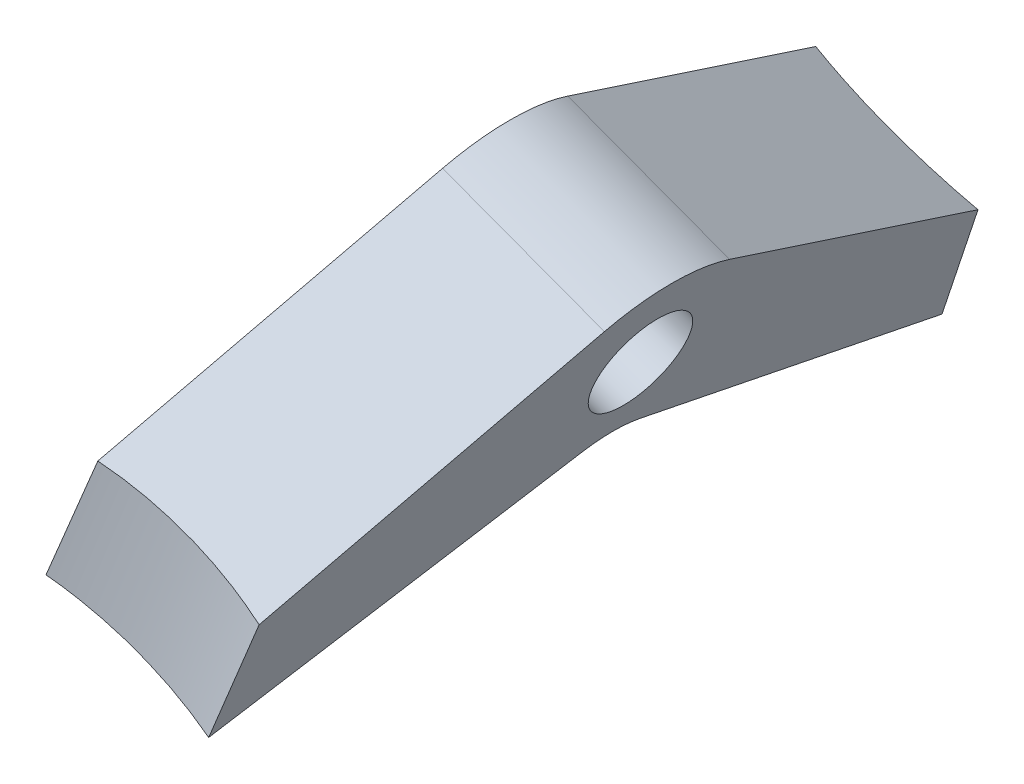
ISO-10303-21;
HEADER;
FILE_DESCRIPTION(('STEP AP214'),'2;1');
FILE_NAME('part.step','',(''),(''),'','','');
FILE_SCHEMA(('AUTOMOTIVE_DESIGN { 1 0 10303 214 1 1 1 1 }'));
ENDSEC;
DATA;
#1=APPLICATION_CONTEXT('core data for automotive mechanical design processes');
#2=APPLICATION_PROTOCOL_DEFINITION('international standard','automotive_design',2000,#1);
#3=PRODUCT_CONTEXT('',#1,'mechanical');
#4=PRODUCT('Part','Part','',(#3));
#5=PRODUCT_RELATED_PRODUCT_CATEGORY('part','',(#4));
#6=PRODUCT_DEFINITION_FORMATION('','',#4);
#7=PRODUCT_DEFINITION_CONTEXT('part definition',#1,'design');
#8=PRODUCT_DEFINITION('design','',#6,#7);
#9=PRODUCT_DEFINITION_SHAPE('','',#8);
#10=(LENGTH_UNIT() NAMED_UNIT(*) SI_UNIT(.MILLI.,.METRE.));
#11=(NAMED_UNIT(*) PLANE_ANGLE_UNIT() SI_UNIT($,.RADIAN.));
#12=(NAMED_UNIT(*) SI_UNIT($,.STERADIAN.) SOLID_ANGLE_UNIT());
#13=UNCERTAINTY_MEASURE_WITH_UNIT(LENGTH_MEASURE(1.E-05),#10,'distance_accuracy_value','');
#14=(GEOMETRIC_REPRESENTATION_CONTEXT(3) GLOBAL_UNCERTAINTY_ASSIGNED_CONTEXT((#13)) GLOBAL_UNIT_ASSIGNED_CONTEXT((#10,
#11,#12)) REPRESENTATION_CONTEXT('',''));
#15=CARTESIAN_POINT('',(0.,0.,0.));
#16=DIRECTION('',(0.,0.,1.));
#17=DIRECTION('',(1.,0.,0.));
#18=AXIS2_PLACEMENT_3D('',#15,#16,#17);
#19=CARTESIAN_POINT('',(-440.159363402594,388.955340973539,1.82761171745082E-12));
#20=DIRECTION('',(0.936746949010764,-0.350007362092606,0.));
#21=DIRECTION('',(0.350007362092606,0.936746949010764,0.));
#22=AXIS2_PLACEMENT_3D('',#19,#20,#21);
#23=PLANE('',#22);
#24=CARTESIAN_POINT('',(-432.537547810981,409.354090470349,-28.4014475028517));
#25=CARTESIAN_POINT('',(-433.547468481025,406.651175592356,-28.5675876473756));
#26=CARTESIAN_POINT('',(-434.557375484195,403.94829729189,-28.7344053815361));
#27=CARTESIAN_POINT('',(-436.577163836364,398.542609350843,-29.0692977530301));
#28=CARTESIAN_POINT('',(-437.587045185367,395.839799710254,-29.2373723902067));
#29=CARTESIAN_POINT('',(-439.074292173246,391.859386069833,-29.4857511303396));
#30=CARTESIAN_POINT('',(-439.551667022951,390.581757418473,-29.565605355142));
#31=CARTESIAN_POINT('',(-440.506411771587,388.026513365829,-29.7255564123936));
#32=CARTESIAN_POINT('',(-440.983781670517,386.748897964545,-29.805653244857));
#33=CARTESIAN_POINT('',(-441.461149241016,385.47128879499,-29.8858632241342));
#34=B_SPLINE_CURVE_WITH_KNOTS('',3,(#24,#25,#26,#27,#28,#29,#30,#31,#32,#33),.UNSPECIFIED.,.F.,
.F.,(4,2,2,2,4),(0.,8.67061810089355,17.3412351202483,21.4399404760988,25.5386460736263),.UNSPECIFIED.);
#35=CARTESIAN_POINT('',(-436.909750498083,397.652486529471,-29.1248080730223));
#36=VERTEX_POINT('',#35);
#37=CARTESIAN_POINT('',(-440.410520596403,388.283153012646,-29.7095172030644));
#38=VERTEX_POINT('',#37);
#39=EDGE_CURVE('E120',#36,#38,#34,.T.);
#40=ORIENTED_EDGE('',*,*,#39,.F.);
#41=DIRECTION('',(0.147919502964028,0.39588636728183,0.906307787036651));
#42=VECTOR('',#41,1.);
#43=CARTESIAN_POINT('',(-438.452634243935,393.523168697513,-38.5781088571552));
#44=LINE('',#43,#42);
#45=CARTESIAN_POINT('',(-432.983970110522,408.159302096284,-5.07141914088655));
#46=VERTEX_POINT('',#45);
#47=EDGE_CURVE('E128',#36,#46,#44,.T.);
#48=ORIENTED_EDGE('',*,*,#47,.T.);
#49=CARTESIAN_POINT('',(-436.790542883938,397.971529443828,1.82761171745082E-12));
#50=DIRECTION('',(0.936746949010764,-0.350007362092606,0.));
#51=DIRECTION('',(0.350007362092606,0.936746949010764,0.));
#52=AXIS2_PLACEMENT_3D('',#49,#50,#51);
#53=CIRCLE('',#52,12.);
#54=CARTESIAN_POINT('',(-432.983970110522,408.159302096284,5.0714191408902));
#55=VERTEX_POINT('',#54);
#56=EDGE_CURVE('E138',#46,#55,#53,.T.);
#57=ORIENTED_EDGE('',*,*,#56,.T.);
#58=DIRECTION('',(-0.14791950296402,-0.395886367281833,0.90630778703665));
#59=VECTOR('',#58,1.);
#60=CARTESIAN_POINT('',(-438.452634243935,393.523168697513,38.5781088571589));
#61=LINE('',#60,#59);
#62=CARTESIAN_POINT('',(-436.909750498082,397.652486529473,29.1248080730222));
#63=VERTEX_POINT('',#62);
#64=EDGE_CURVE('E140',#55,#63,#61,.T.);
#65=ORIENTED_EDGE('',*,*,#64,.T.);
#66=CARTESIAN_POINT('',(-441.461149241016,385.47128879499,29.8858632241342));
#67=CARTESIAN_POINT('',(-440.451300886093,388.174010131424,29.7161750917279));
#68=CARTESIAN_POINT('',(-439.441441791488,390.876760211156,29.54700749103));
#69=CARTESIAN_POINT('',(-437.421700090171,396.282323297564,29.2098286661728));
#70=CARTESIAN_POINT('',(-436.411817483463,398.985136304231,29.04181744186));
#71=CARTESIAN_POINT('',(-434.924532123886,402.965652641265,28.7953216591227));
#72=CARTESIAN_POINT('',(-434.447139393427,404.243329148021,28.7163433571959));
#73=CARTESIAN_POINT('',(-433.492348038862,406.798697935075,28.5586766101273));
#74=CARTESIAN_POINT('',(-433.014949414755,408.076390215375,28.4799881650037));
#75=CARTESIAN_POINT('',(-432.537547810981,409.354090470349,28.4014475028518));
#76=B_SPLINE_CURVE_WITH_KNOTS('',3,(#66,#67,#68,#69,#70,#71,#72,#73,#74,#75),.UNSPECIFIED.,.F.,
.F.,(4,2,2,2,4),(0.,8.6706178921429,17.3412346335936,21.4399402330747,25.5386460896858),.UNSPECIFIED.);
#77=CARTESIAN_POINT('',(-440.410520596393,388.283153012672,29.7095172030628));
#78=VERTEX_POINT('',#77);
#79=EDGE_CURVE('E79',#78,#63,#76,.T.);
#80=ORIENTED_EDGE('',*,*,#79,.F.);
#81=DIRECTION('',(0.102332249120521,0.273878302376099,-0.956304755963036));
#82=VECTOR('',#81,1.);
#83=CARTESIAN_POINT('',(-441.40824251317,385.612886433382,39.0333249208962));
#84=LINE('',#83,#82);
#85=CARTESIAN_POINT('',(-437.481653762664,396.121865473322,2.3389736377837));
#86=VERTEX_POINT('',#85);
#87=EDGE_CURVE('E249',#78,#86,#84,.T.);
#88=ORIENTED_EDGE('',*,*,#87,.T.);
#89=CARTESIAN_POINT('',(-440.159363402594,388.955340973539,1.82761171745082E-12));
#90=DIRECTION('',(-0.936746949010764,0.350007362092606,0.));
#91=DIRECTION('',(0.350007362092606,0.936746949010764,0.));
#92=AXIS2_PLACEMENT_3D('',#89,#90,#91);
#93=CIRCLE('',#92,8.00000000000003);
#94=CARTESIAN_POINT('',(-437.481653762664,396.121865473322,-2.33897363778005));
#95=VERTEX_POINT('',#94);
#96=EDGE_CURVE('E142',#86,#95,#93,.T.);
#97=ORIENTED_EDGE('',*,*,#96,.T.);
#98=DIRECTION('',(-0.102332249120525,-0.273878302376096,-0.956304755963037));
#99=VECTOR('',#98,1.);
#100=CARTESIAN_POINT('',(-441.40824251317,385.612886433382,-39.0333249208926));
#101=LINE('',#100,#99);
#102=EDGE_CURVE('E131',#95,#38,#101,.T.);
#103=ORIENTED_EDGE('',*,*,#102,.T.);
#104=EDGE_LOOP('',(#40,#48,#57,#65,#80,#88,#97,#103));
#105=FACE_BOUND('',#104,.T.);
#106=CARTESIAN_POINT('',(-435.131320724038,402.412211167564,1.82761171745082E-12));
#107=DIRECTION('',(-0.936746949010764,0.350007362092606,0.));
#108=DIRECTION('',(-0.350007362092606,-0.936746949010764,0.));
#109=AXIS2_PLACEMENT_3D('',#106,#107,#108);
#110=CIRCLE('',#109,4.);
#111=CARTESIAN_POINT('',(-436.531350172408,398.665223371521,1.82761171745082E-12));
#112=VERTEX_POINT('',#111);
#113=EDGE_CURVE('E263',#112,#112,#110,.T.);
#114=ORIENTED_EDGE('',*,*,#113,.T.);
#115=EDGE_LOOP('',(#114));
#116=FACE_BOUND('',#115,.T.);
#117=ADVANCED_FACE('F51',(#105,#116),#23,.T.);
#118=CARTESIAN_POINT('',(-453.273820688745,393.855444042836,1.87649248450635E-12));
#119=DIRECTION('',(0.936746949010764,-0.350007362092606,0.));
#120=DIRECTION('',(0.350007362092606,0.936746949010764,0.));
#121=AXIS2_PLACEMENT_3D('',#118,#119,#120);
#122=PLANE('',#121);
#123=DIRECTION('',(0.147919502964028,0.39588636728183,0.906307787036651));
#124=VECTOR('',#123,1.);
#125=CARTESIAN_POINT('',(-451.567091530086,398.42327176681,-38.5781088571552));
#126=LINE('',#125,#124);
#127=CARTESIAN_POINT('',(-450.017747476125,402.569879731964,-29.0852255472009));
#128=VERTEX_POINT('',#127);
#129=CARTESIAN_POINT('',(-446.098427396673,413.05940516558,-5.0714191408865));
#130=VERTEX_POINT('',#129);
#131=EDGE_CURVE('E233',#128,#130,#126,.T.);
#132=ORIENTED_EDGE('',*,*,#131,.F.);
#133=CARTESIAN_POINT('',(-445.652005097132,414.254193539646,-28.2300543513848));
#134=CARTESIAN_POINT('',(-446.661225879503,411.553151815514,-28.4278802092125));
#135=CARTESIAN_POINT('',(-447.670446697856,408.852109995087,-28.6257054460732));
#136=CARTESIAN_POINT('',(-449.688897729712,403.450001209392,-29.0209625715463));
#137=CARTESIAN_POINT('',(-450.698127943216,400.748934244124,-29.2183944601733));
#138=CARTESIAN_POINT('',(-452.185402490586,396.768446844483,-29.5087629093765));
#139=CARTESIAN_POINT('',(-452.663439535833,395.489045917109,-29.6020040821829));
#140=CARTESIAN_POINT('',(-453.619518858075,392.9302300603,-29.7882675574307));
#141=CARTESIAN_POINT('',(-454.097561135069,391.650815130867,-29.8812898598684));
#142=CARTESIAN_POINT('',(-454.575606527167,390.371391864287,-29.9741813979328));
#143=B_SPLINE_CURVE_WITH_KNOTS('',3,(#133,#134,#135,#136,#137,#138,#139,#140,#141,#142),
.UNSPECIFIED.,.F.,.F.,(4,2,2,2,4),(0.,8.67061671904777,17.3412331146473,21.4481444174191,
25.5550557927574),.UNSPECIFIED.);
#144=CARTESIAN_POINT('',(-453.531568615579,393.165616884251,-29.7711082400242));
#145=VERTEX_POINT('',#144);
#146=EDGE_CURVE('E72',#128,#145,#143,.T.);
#147=ORIENTED_EDGE('',*,*,#146,.T.);
#148=DIRECTION('',(-0.102332249120525,-0.273878302376096,-0.956304755963037));
#149=VECTOR('',#148,1.);
#150=CARTESIAN_POINT('',(-454.522699799321,390.512989502678,-39.0333249208926));
#151=LINE('',#150,#149);
#152=CARTESIAN_POINT('',(-450.596111048815,401.021968542619,-2.33897363778001));
#153=VERTEX_POINT('',#152);
#154=EDGE_CURVE('E231',#153,#145,#151,.T.);
#155=ORIENTED_EDGE('',*,*,#154,.F.);
#156=CARTESIAN_POINT('',(-453.273820688745,393.855444042836,1.87649248450635E-12));
#157=DIRECTION('',(-0.936746949010764,0.350007362092606,0.));
#158=DIRECTION('',(0.350007362092606,0.936746949010764,0.));
#159=AXIS2_PLACEMENT_3D('',#156,#157,#158);
#160=CIRCLE('',#159,8.00000000000003);
#161=CARTESIAN_POINT('',(-450.596111048815,401.021968542619,2.33897363778375));
#162=VERTEX_POINT('',#161);
#163=EDGE_CURVE('E237',#162,#153,#160,.T.);
#164=ORIENTED_EDGE('',*,*,#163,.F.);
#165=DIRECTION('',(0.102332249120521,0.273878302376099,-0.956304755963036));
#166=VECTOR('',#165,1.);
#167=CARTESIAN_POINT('',(-454.52269979932,390.512989502678,39.0333249208963));
#168=LINE('',#167,#166);
#169=CARTESIAN_POINT('',(-453.531568615579,393.165616884252,29.7711082400242));
#170=VERTEX_POINT('',#169);
#171=EDGE_CURVE('E241',#170,#162,#168,.T.);
#172=ORIENTED_EDGE('',*,*,#171,.F.);
#173=CARTESIAN_POINT('',(-454.575606527166,390.371391864287,29.9741813979327));
#174=CARTESIAN_POINT('',(-453.566344787801,393.072543204222,29.7780651001336));
#175=CARTESIAN_POINT('',(-452.557096909745,395.773657446255,29.5813683152548));
#176=CARTESIAN_POINT('',(-450.538619496861,401.175836837173,29.1872086840957));
#177=CARTESIAN_POINT('',(-449.529389962032,403.87690198606,28.989745837833));
#178=CARTESIAN_POINT('',(-448.042136912125,407.857331850671,28.6984795682822));
#179=CARTESIAN_POINT('',(-447.564109938754,409.136705822045,28.6048200888178));
#180=CARTESIAN_POINT('',(-446.608057003742,411.695451057034,28.4174587659763));
#181=CARTESIAN_POINT('',(-446.130031042101,412.974822320648,28.3237569225987));
#182=CARTESIAN_POINT('',(-445.652005097131,414.254193539645,28.2300543513847));
#183=B_SPLINE_CURVE_WITH_KNOTS('',3,(#173,#174,#175,#176,#177,#178,#179,#180,#181,#182),
.UNSPECIFIED.,.F.,.F.,(4,2,2,2,4),(0.,8.67061709889206,17.341233997343,21.4481448579432,
25.5550557635129),.UNSPECIFIED.);
#184=CARTESIAN_POINT('',(-450.017747476124,402.569879731966,29.0852255472006));
#185=VERTEX_POINT('',#184);
#186=EDGE_CURVE('E198',#170,#185,#183,.T.);
#187=ORIENTED_EDGE('',*,*,#186,.T.);
#188=DIRECTION('',(-0.14791950296402,-0.395886367281833,0.90630778703665));
#189=VECTOR('',#188,1.);
#190=CARTESIAN_POINT('',(-451.567091530086,398.423271766809,38.5781088571589));
#191=LINE('',#190,#189);
#192=CARTESIAN_POINT('',(-446.098427396673,413.05940516558,5.07141914089025));
#193=VERTEX_POINT('',#192);
#194=EDGE_CURVE('E246',#193,#185,#191,.T.);
#195=ORIENTED_EDGE('',*,*,#194,.F.);
#196=CARTESIAN_POINT('',(-449.905000170089,402.871632513125,1.87649248450635E-12));
#197=DIRECTION('',(0.936746949010764,-0.350007362092606,0.));
#198=DIRECTION('',(0.350007362092606,0.936746949010764,0.));
#199=AXIS2_PLACEMENT_3D('',#196,#197,#198);
#200=CIRCLE('',#199,12.);
#201=EDGE_CURVE('E239',#130,#193,#200,.T.);
#202=ORIENTED_EDGE('',*,*,#201,.F.);
#203=EDGE_LOOP('',(#132,#147,#155,#164,#172,#187,#195,#202));
#204=FACE_BOUND('',#203,.T.);
#205=CARTESIAN_POINT('',(-448.245778010189,407.312314236861,1.87649248450635E-12));
#206=DIRECTION('',(0.936746949010764,-0.350007362092606,0.));
#207=DIRECTION('',(0.350007362092606,0.936746949010764,0.));
#208=AXIS2_PLACEMENT_3D('',#205,#206,#207);
#209=CIRCLE('',#208,3.25);
#210=CARTESIAN_POINT('',(-447.108254083388,410.356741821146,1.87649248450635E-12));
#211=VERTEX_POINT('',#210);
#212=EDGE_CURVE('E160',#211,#211,#209,.T.);
#213=ORIENTED_EDGE('',*,*,#212,.T.);
#214=EDGE_LOOP('',(#213));
#215=FACE_BOUND('',#214,.T.);
#216=ADVANCED_FACE('F212',(#204,#215),#122,.F.);
#217=CARTESIAN_POINT('',(-441.40824251317,385.612886433382,39.0333249208962));
#218=DIRECTION('',(0.334713704991236,0.895815562472857,0.292371704722735));
#219=DIRECTION('',(-0.936746949010764,0.350007362092607,0.));
#220=AXIS2_PLACEMENT_3D('',#217,#218,#219);
#221=PLANE('',#220);
#222=ORIENTED_EDGE('',*,*,#87,.F.);
#223=CARTESIAN_POINT('',(-440.410520596402,388.283153012647,29.7095172030643));
#224=CARTESIAN_POINT('',(-440.672249021889,388.396953943376,29.6604681550793));
#225=CARTESIAN_POINT('',(-440.934894362121,388.510026750069,29.6146997555236));
#226=CARTESIAN_POINT('',(-441.461846534983,388.734693971974,29.529594804441));
#227=CARTESIAN_POINT('',(-441.726153324202,388.846288425576,29.4902580855906));
#228=CARTESIAN_POINT('',(-442.5211929769,389.178773453467,29.3817161371333));
#229=CARTESIAN_POINT('',(-443.054178499893,389.397423632801,29.3219542860566));
#230=CARTESIAN_POINT('',(-444.120560627821,389.826780604139,29.2272394304157));
#231=CARTESIAN_POINT('',(-444.653920366959,390.037536682387,29.1920932099248));
#232=CARTESIAN_POINT('',(-445.456579799746,390.348889157489,29.1570238791684));
#233=CARTESIAN_POINT('',(-445.724592212065,390.451884829056,29.1482757756238));
#234=CARTESIAN_POINT('',(-446.261360621711,390.656251759372,29.1366079792472));
#235=CARTESIAN_POINT('',(-446.530116608318,390.757623041402,29.1336882028105));
#236=CARTESIAN_POINT('',(-447.170088738944,390.996731022107,29.1337251171406));
#237=CARTESIAN_POINT('',(-447.541590393099,391.133712122671,29.1393237896391));
#238=CARTESIAN_POINT('',(-448.285457304385,391.404284191205,29.1618970415209));
#239=CARTESIAN_POINT('',(-448.657822511482,391.537875350484,29.1788709774617));
#240=CARTESIAN_POINT('',(-449.40308009909,391.801459208616,29.2244479124876));
#241=CARTESIAN_POINT('',(-449.775972427839,391.931452238059,29.2530498394026));
#242=CARTESIAN_POINT('',(-450.525044522106,392.18867449237,29.3224854148134));
#243=CARTESIAN_POINT('',(-450.90122601682,392.315872047354,29.3634180782281));
#244=CARTESIAN_POINT('',(-451.653445462958,392.566122259601,29.4578188793152));
#245=CARTESIAN_POINT('',(-452.029483396693,392.689174509252,29.5112882456374));
#246=CARTESIAN_POINT('',(-452.781053956678,392.930829675018,29.6312810762838));
#247=CARTESIAN_POINT('',(-453.156586353688,393.049430981645,29.6978092095726));
#248=CARTESIAN_POINT('',(-453.531568615579,393.165616884252,29.7711082400243));
#249=B_SPLINE_CURVE_WITH_KNOTS('',3,(#223,#224,#225,#226,#227,#228,#229,#230,#231,#232,#233,
#234,#235,#236,#237,#238,#239,#240,#241,#242,#243,#244,#245,#246,#247,#248),.UNSPECIFIED.,.F.,
.F.,(4,2,2,2,2,2,2,2,2,2,2,2,4),(0.,0.868703663685519,1.73738472399406,3.47430472073009,
5.19743347894888,6.05914268599288,6.92083953211618,8.10862951033806,9.29635230680691,
10.4839656129928,11.6813817718673,12.8789153316819,14.0768778339635),.UNSPECIFIED.);
#250=EDGE_CURVE('E190',#78,#170,#249,.T.);
#251=ORIENTED_EDGE('',*,*,#250,.T.);
#252=ORIENTED_EDGE('',*,*,#171,.T.);
#253=DIRECTION('',(-0.936746949010764,0.350007362092606,0.));
#254=VECTOR('',#253,1.);
#255=CARTESIAN_POINT('',(-437.481653762664,396.121865473322,2.3389736377837));
#256=LINE('',#255,#254);
#257=EDGE_CURVE('E155',#86,#162,#256,.T.);
#258=ORIENTED_EDGE('',*,*,#257,.F.);
#259=EDGE_LOOP('',(#222,#251,#252,#258));
#260=FACE_BOUND('',#259,.T.);
#261=ADVANCED_FACE('F53',(#260),#221,.F.);
#262=CARTESIAN_POINT('',(-440.159363402594,388.955340973539,1.82761171745082E-12));
#263=DIRECTION('',(-0.936746949010764,0.350007362092606,0.));
#264=DIRECTION('',(-0.350007362092606,-0.936746949010764,0.));
#265=AXIS2_PLACEMENT_3D('',#262,#263,#264);
#266=CYLINDRICAL_SURFACE('',#265,8.00000000000003);
#267=ORIENTED_EDGE('',*,*,#163,.T.);
#268=DIRECTION('',(-0.936746949010764,0.350007362092606,0.));
#269=VECTOR('',#268,1.);
#270=CARTESIAN_POINT('',(-437.481653762664,396.121865473322,-2.33897363778005));
#271=LINE('',#270,#269);
#272=EDGE_CURVE('E152',#95,#153,#271,.T.);
#273=ORIENTED_EDGE('',*,*,#272,.F.);
#274=ORIENTED_EDGE('',*,*,#96,.F.);
#275=ORIENTED_EDGE('',*,*,#257,.T.);
#276=EDGE_LOOP('',(#267,#273,#274,#275));
#277=FACE_BOUND('',#276,.T.);
#278=ADVANCED_FACE('F254',(#277),#266,.F.);
#279=CARTESIAN_POINT('',(-441.40824251317,385.612886433382,-39.0333249208926));
#280=DIRECTION('',(0.334713704991235,0.895815562472858,-0.292371704722734));
#281=DIRECTION('',(-0.936746949010765,0.350007362092605,0.));
#282=AXIS2_PLACEMENT_3D('',#279,#280,#281);
#283=PLANE('',#282);
#284=ORIENTED_EDGE('',*,*,#154,.T.);
#285=CARTESIAN_POINT('',(-453.531568615579,393.165616884251,-29.7711082400243));
#286=CARTESIAN_POINT('',(-453.191409587863,393.06022223186,-29.7046116593843));
#287=CARTESIAN_POINT('',(-452.850794626294,392.952837092426,-29.643691890503));
#288=CARTESIAN_POINT('',(-452.169033814267,392.734351087119,-29.5326294208783));
#289=CARTESIAN_POINT('',(-451.827888017255,392.623250574823,-29.4824856979754));
#290=CARTESIAN_POINT('',(-451.145446506303,392.397600359771,-29.3925948096732));
#291=CARTESIAN_POINT('',(-450.804150833038,392.283051314811,-29.3528456753812));
#292=CARTESIAN_POINT('',(-450.121635334119,392.050691580938,-29.2834277894014));
#293=CARTESIAN_POINT('',(-449.780415511523,391.932880778485,-29.2537593891015));
#294=CARTESIAN_POINT('',(-449.06051829555,391.680953513636,-29.201500228378));
#295=CARTESIAN_POINT('',(-448.681882989441,391.546477566485,-29.1800590977517));
#296=CARTESIAN_POINT('',(-447.925414565022,391.273963275573,-29.1490102441724));
#297=CARTESIAN_POINT('',(-447.547581450456,391.135924915229,-29.1394025763137));
#298=CARTESIAN_POINT('',(-446.792974195127,390.856462816779,-29.1317722437755));
#299=CARTESIAN_POINT('',(-446.416200247283,390.715038501602,-29.1337515680777));
#300=CARTESIAN_POINT('',(-445.664117877248,390.429006349907,-29.1491421693238));
#301=CARTESIAN_POINT('',(-445.288809463488,390.284398495107,-29.162553511933));
#302=CARTESIAN_POINT('',(-444.153995096689,389.841389233578,-29.220755688593));
#303=CARTESIAN_POINT('',(-443.397188686759,389.538090646839,-29.2836417899198));
#304=CARTESIAN_POINT('',(-442.270305913817,389.074155424948,-29.4150405645151));
#305=CARTESIAN_POINT('',(-441.896101598375,388.918027856057,-29.4650118608564));
#306=CARTESIAN_POINT('',(-441.150839052085,388.602803369036,-29.577654132849));
#307=CARTESIAN_POINT('',(-440.779781046713,388.44370624067,-29.6403260107849));
#308=CARTESIAN_POINT('',(-440.410520596403,388.283153012646,-29.7095172030644));
#309=B_SPLINE_CURVE_WITH_KNOTS('',3,(#285,#286,#287,#288,#289,#290,#291,#292,#293,#294,#295,
#296,#297,#298,#299,#300,#301,#302,#303,#304,#305,#306,#307,#308),.UNSPECIFIED.,.F.,.F.,(4,2,2,
2,2,2,2,2,2,2,2,4),(0.,1.08673067298697,2.17335821884525,3.25977979166015,4.34623923040868,
5.55317377733801,6.76011394350542,7.96726129478383,9.1744155799337,11.6257399951942,
12.8511673110903,14.0766817152781),.UNSPECIFIED.);
#310=EDGE_CURVE('E132',#145,#38,#309,.T.);
#311=ORIENTED_EDGE('',*,*,#310,.T.);
#312=ORIENTED_EDGE('',*,*,#102,.F.);
#313=ORIENTED_EDGE('',*,*,#272,.T.);
#314=EDGE_LOOP('',(#284,#311,#312,#313));
#315=FACE_BOUND('',#314,.T.);
#316=ADVANCED_FACE('F235',(#315),#283,.F.);
#317=CARTESIAN_POINT('',(-438.452634243935,393.523168697513,-38.5781088571552));
#318=DIRECTION('',(-0.317214397784684,-0.84898105437128,0.422618261740698));
#319=DIRECTION('',(0.,-0.445633516961104,-0.895215487221305));
#320=AXIS2_PLACEMENT_3D('',#317,#318,#319);
#321=PLANE('',#320);
#322=ORIENTED_EDGE('',*,*,#47,.F.);
#323=CARTESIAN_POINT('',(-432.872471382005,395.563010301787,-30.2919196534261));
#324=CARTESIAN_POINT('',(-433.061037804947,395.669645448798,-30.2192412151582));
#325=CARTESIAN_POINT('',(-433.250948222736,395.775555782809,-30.1490276183692));
#326=CARTESIAN_POINT('',(-433.63325932048,395.985919765294,-30.0133958764331));
#327=CARTESIAN_POINT('',(-433.82565987665,396.090373485644,-29.9479774939829));
#328=CARTESIAN_POINT('',(-434.405749362834,396.401244555392,-29.7588921685676));
#329=CARTESIAN_POINT('',(-434.796891346133,396.605490818105,-29.6421784738367));
#330=CARTESIAN_POINT('',(-435.586732721956,397.007954320472,-29.4265350895853));
#331=CARTESIAN_POINT('',(-435.985427267489,397.206175227536,-29.3275943946315));
#332=CARTESIAN_POINT('',(-436.789469555453,397.596634212195,-29.1467255178355));
#333=CARTESIAN_POINT('',(-437.194816364333,397.788873118496,-29.0647949705215));
#334=CARTESIAN_POINT('',(-438.002184685645,398.1631036762,-28.9190232346571));
#335=CARTESIAN_POINT('',(-438.404079617336,398.345228146842,-28.8548202201641));
#336=CARTESIAN_POINT('',(-439.212718040044,398.703669584737,-28.7417199499739));
#337=CARTESIAN_POINT('',(-439.619462877371,398.879984885752,-28.6928270520498));
#338=CARTESIAN_POINT('',(-440.437097154244,399.22669828317,-28.6100390040014));
#339=CARTESIAN_POINT('',(-440.847987595736,399.397094902632,-28.5761475729039));
#340=CARTESIAN_POINT('',(-441.673224500523,399.731823082239,-28.5231426341765));
#341=CARTESIAN_POINT('',(-442.087571361774,399.896153931847,-28.5040308526195));
#342=CARTESIAN_POINT('',(-443.001577741201,400.250623916626,-28.4779971498785));
#343=CARTESIAN_POINT('',(-443.501854119091,400.439415222493,-28.4742458402064));
#344=CARTESIAN_POINT('',(-444.505395415253,400.807553321518,-28.4879591057561));
#345=CARTESIAN_POINT('',(-445.008659288,400.986903224354,-28.5054166493064));
#346=CARTESIAN_POINT('',(-446.017263809995,401.335513147997,-28.5621597143353));
#347=CARTESIAN_POINT('',(-446.522603668725,401.504776686472,-28.6014375759561));
#348=CARTESIAN_POINT('',(-447.544862768123,401.835882658233,-28.7035926683632));
#349=CARTESIAN_POINT('',(-448.061807700752,401.997502903692,-28.76693552767));
#350=CARTESIAN_POINT('',(-449.09600971434,402.30863837962,-28.9181728269282));
#351=CARTESIAN_POINT('',(-449.613266841108,402.458149325309,-29.0060759087848));
#352=CARTESIAN_POINT('',(-450.388417612391,402.672466027095,-29.1573664975767));
#353=CARTESIAN_POINT('',(-450.646844441537,402.742288278348,-29.2110767712374));
#354=CARTESIAN_POINT('',(-451.163167351861,402.878405355893,-29.3251850467537));
#355=CARTESIAN_POINT('',(-451.421063397576,402.944699953405,-29.3855834815786));
#356=CARTESIAN_POINT('',(-451.678590258603,403.009140383778,-29.4494295716673));
#357=B_SPLINE_CURVE_WITH_KNOTS('',3,(#323,#324,#325,#326,#327,#328,#329,#330,#331,#332,#333,
#334,#335,#336,#337,#338,#339,#340,#341,#342,#343,#344,#345,#346,#347,#348,#349,#350,#351,#352,
#353,#354,#355,#356),.UNSPECIFIED.,.F.,.F.,(4,2,2,2,2,2,2,2,2,2,2,2,2,2,2,2,4),(0.,
0.6854468488746,1.37085975376761,2.73963504146789,4.10755980944943,5.47529422293549,
6.81260616152956,8.15029839872651,9.4883220788966,10.8265019994299,12.4301669737691,
14.0333004074259,15.6358714284969,17.2711747709147,18.9070542470511,19.7260465770805,
20.5450919569694),.UNSPECIFIED.);
#358=EDGE_CURVE('E12',#36,#128,#357,.T.);
#359=ORIENTED_EDGE('',*,*,#358,.T.);
#360=ORIENTED_EDGE('',*,*,#131,.T.);
#361=DIRECTION('',(-0.936746949010764,0.350007362092606,0.));
#362=VECTOR('',#361,1.);
#363=CARTESIAN_POINT('',(-432.983970110522,408.159302096284,-5.07141914088655));
#364=LINE('',#363,#362);
#365=EDGE_CURVE('E136',#46,#130,#364,.T.);
#366=ORIENTED_EDGE('',*,*,#365,.F.);
#367=EDGE_LOOP('',(#322,#359,#360,#366));
#368=FACE_BOUND('',#367,.T.);
#369=ADVANCED_FACE('F134',(#368),#321,.F.);
#370=CARTESIAN_POINT('',(-436.790542883938,397.971529443828,1.82761171745082E-12));
#371=DIRECTION('',(-0.936746949010764,0.350007362092606,0.));
#372=DIRECTION('',(-0.350007362092606,-0.936746949010764,0.));
#373=AXIS2_PLACEMENT_3D('',#370,#371,#372);
#374=CYLINDRICAL_SURFACE('',#373,12.);
#375=ORIENTED_EDGE('',*,*,#201,.T.);
#376=DIRECTION('',(-0.936746949010764,0.350007362092606,0.));
#377=VECTOR('',#376,1.);
#378=CARTESIAN_POINT('',(-432.983970110522,408.159302096284,5.0714191408902));
#379=LINE('',#378,#377);
#380=EDGE_CURVE('E148',#55,#193,#379,.T.);
#381=ORIENTED_EDGE('',*,*,#380,.F.);
#382=ORIENTED_EDGE('',*,*,#56,.F.);
#383=ORIENTED_EDGE('',*,*,#365,.T.);
#384=EDGE_LOOP('',(#375,#381,#382,#383));
#385=FACE_BOUND('',#384,.T.);
#386=ADVANCED_FACE('F270',(#385),#374,.T.);
#387=CARTESIAN_POINT('',(-438.452634243935,393.523168697513,38.5781088571589));
#388=DIRECTION('',(-0.317214397784687,-0.848981054371279,-0.422618261740698));
#389=DIRECTION('',(0.,0.445633516961105,-0.895215487221304));
#390=AXIS2_PLACEMENT_3D('',#387,#388,#389);
#391=PLANE('',#390);
#392=ORIENTED_EDGE('',*,*,#194,.T.);
#393=CARTESIAN_POINT('',(-451.678590258603,403.009140383779,29.4494295716672));
#394=CARTESIAN_POINT('',(-451.389706548251,402.93685200954,29.3778126663678));
#395=CARTESIAN_POINT('',(-451.100347265614,402.862229867952,29.310527012353));
#396=CARTESIAN_POINT('',(-450.52105160708,402.708589410647,29.1843538417834));
#397=CARTESIAN_POINT('',(-450.231115409858,402.629572298007,29.1254640425292));
#398=CARTESIAN_POINT('',(-449.65090274992,402.467379328911,29.0157833784627));
#399=CARTESIAN_POINT('',(-449.360626312677,402.38420376649,28.9649919420927));
#400=CARTESIAN_POINT('',(-448.780147132394,402.213953386598,28.8712974424538));
#401=CARTESIAN_POINT('',(-448.489944455865,402.126881027263,28.8283894910525));
#402=CARTESIAN_POINT('',(-447.909643527166,401.948972125421,28.7502136866591));
#403=CARTESIAN_POINT('',(-447.619545283874,401.85813531607,28.7149463763823));
#404=CARTESIAN_POINT('',(-447.039676635404,401.672868815355,28.6518754269821));
#405=CARTESIAN_POINT('',(-446.749906240917,401.578439010111,28.6240720246526));
#406=CARTESIAN_POINT('',(-446.171266192389,401.38626259697,28.5758043028799));
#407=CARTESIAN_POINT('',(-445.882395862358,401.288520341293,28.5553307330388));
#408=CARTESIAN_POINT('',(-445.305384023092,401.089746586045,28.5215382728257));
#409=CARTESIAN_POINT('',(-445.017242484431,400.988715221639,28.508219088835));
#410=CARTESIAN_POINT('',(-444.441865792342,400.783489688705,28.4886146791454));
#411=CARTESIAN_POINT('',(-444.154630592388,400.679295685549,28.4823290863112));
#412=CARTESIAN_POINT('',(-443.58110983607,400.467812813631,28.4766878493711));
#413=CARTESIAN_POINT('',(-443.294824686454,400.360522772501,28.4773348656897));
#414=CARTESIAN_POINT('',(-442.723456911542,400.142990125607,28.485462794837));
#415=CARTESIAN_POINT('',(-442.438374351437,400.032747362095,28.4929440734909));
#416=CARTESIAN_POINT('',(-441.869558407257,399.809345482872,28.5147778573654));
#417=CARTESIAN_POINT('',(-441.585825302854,399.696185791374,28.5291317291792));
#418=CARTESIAN_POINT('',(-440.813262044715,399.383297899081,28.5777990629888));
#419=CARTESIAN_POINT('',(-440.326001749321,399.180711077775,28.6190334192957));
#420=CARTESIAN_POINT('',(-439.357266999296,398.767145457537,28.7227032555173));
#421=CARTESIAN_POINT('',(-438.875793284272,398.556165600401,28.7851414163597));
#422=CARTESIAN_POINT('',(-437.91993279634,398.126023232466,28.9317749568957));
#423=CARTESIAN_POINT('',(-437.445544954615,397.906861973544,29.015967019494));
#424=CARTESIAN_POINT('',(-436.504403378562,397.46011158714,29.2070116645583));
#425=CARTESIAN_POINT('',(-436.037663107636,397.232509507092,29.3139003724596));
#426=CARTESIAN_POINT('',(-435.114123622411,396.769276614324,29.5512680803103));
#427=CARTESIAN_POINT('',(-434.657325753518,396.533644725946,29.6817502509613));
#428=CARTESIAN_POINT('',(-433.981016210885,396.17421333338,29.8961643607048));
#429=CARTESIAN_POINT('',(-433.756960202325,396.053348809565,29.9707893873401));
#430=CARTESIAN_POINT('',(-433.312157351573,395.809652355244,30.126475523644));
#431=CARTESIAN_POINT('',(-433.091410752804,395.686820281376,30.2075371040166));
#432=CARTESIAN_POINT('',(-432.872471382005,395.563010301789,30.2919196534258));
#433=B_SPLINE_CURVE_WITH_KNOTS('',3,(#393,#394,#395,#396,#397,#398,#399,#400,#401,#402,#403,
#404,#405,#406,#407,#408,#409,#410,#411,#412,#413,#414,#415,#416,#417,#418,#419,#420,#421,#422,
#423,#424,#425,#426,#427,#428,#429,#430,#431,#432),.UNSPECIFIED.,.F.,.F.,(4,2,2,2,2,2,2,2,2,2,2,
2,2,2,2,2,2,2,2,4),(0.,0.918785166926755,1.83732005242515,2.75579008181552,3.67368868027767,
4.59165245578704,5.50964535043144,6.42647560118808,7.34326822202761,8.26001298643364,
9.17710956897268,10.0942552448622,11.011583368043,12.5989526012435,14.1865226100844,
15.7738506845478,17.3637244484315,18.953812032859,19.7495860007653,20.545418217177),.UNSPECIFIED.);
#434=EDGE_CURVE('E65',#185,#63,#433,.T.);
#435=ORIENTED_EDGE('',*,*,#434,.T.);
#436=ORIENTED_EDGE('',*,*,#64,.F.);
#437=ORIENTED_EDGE('',*,*,#380,.T.);
#438=EDGE_LOOP('',(#392,#435,#436,#437));
#439=FACE_BOUND('',#438,.T.);
#440=ADVANCED_FACE('F167',(#439),#391,.F.);
#441=CARTESIAN_POINT('',(-435.131320724038,402.412211167564,1.82761171745082E-12));
#442=DIRECTION('',(-0.936746949010764,0.350007362092606,0.));
#443=DIRECTION('',(-0.350007362092606,-0.936746949010764,0.));
#444=AXIS2_PLACEMENT_3D('',#441,#442,#443);
#445=CYLINDRICAL_SURFACE('',#444,3.25);
#446=CARTESIAN_POINT('',(-445.435537163156,406.262292150583,1.86601803442302E-12));
#447=DIRECTION('',(-0.936746949010764,0.350007362092606,0.));
#448=DIRECTION('',(-0.350007362092606,-0.936746949010764,0.));
#449=AXIS2_PLACEMENT_3D('',#446,#447,#448);
#450=CIRCLE('',#449,3.25);
#451=CARTESIAN_POINT('',(-446.573061089957,403.217864566298,1.86601803442302E-12));
#452=VERTEX_POINT('',#451);
#453=EDGE_CURVE('E158',#452,#452,#450,.T.);
#454=ORIENTED_EDGE('',*,*,#453,.F.);
#455=EDGE_LOOP('',(#454));
#456=FACE_BOUND('',#455,.T.);
#457=ORIENTED_EDGE('',*,*,#212,.F.);
#458=EDGE_LOOP('',(#457));
#459=FACE_BOUND('',#458,.T.);
#460=ADVANCED_FACE('F217',(#456,#459),#445,.F.);
#461=CARTESIAN_POINT('',(-445.435537163156,406.262292150583,1.86601803442302E-12));
#462=DIRECTION('',(0.936746949010764,-0.350007362092606,0.));
#463=DIRECTION('',(0.350007362092606,0.936746949010764,0.));
#464=AXIS2_PLACEMENT_3D('',#461,#462,#463);
#465=CYLINDRICAL_SURFACE('',#464,4.);
#466=CARTESIAN_POINT('',(-445.435537163156,406.262292150583,1.86601803442302E-12));
#467=DIRECTION('',(-0.936746949010764,0.350007362092606,0.));
#468=DIRECTION('',(-0.350007362092606,-0.936746949010764,0.));
#469=AXIS2_PLACEMENT_3D('',#466,#467,#468);
#470=CIRCLE('',#469,4.);
#471=CARTESIAN_POINT('',(-446.835566611527,402.51530435454,1.86601803442302E-12));
#472=VERTEX_POINT('',#471);
#473=EDGE_CURVE('E161',#472,#472,#470,.T.);
#474=ORIENTED_EDGE('',*,*,#473,.T.);
#475=EDGE_LOOP('',(#474));
#476=FACE_BOUND('',#475,.T.);
#477=ORIENTED_EDGE('',*,*,#113,.F.);
#478=EDGE_LOOP('',(#477));
#479=FACE_BOUND('',#478,.T.);
#480=ADVANCED_FACE('F313',(#476,#479),#465,.F.);
#481=CARTESIAN_POINT('',(-445.435537163156,406.262292150583,1.86601803442302E-12));
#482=DIRECTION('',(-0.936746949010764,0.350007362092606,0.));
#483=DIRECTION('',(-0.350007362092606,-0.936746949010764,0.));
#484=AXIS2_PLACEMENT_3D('',#481,#482,#483);
#485=PLANE('',#484);
#486=ORIENTED_EDGE('',*,*,#453,.T.);
#487=EDGE_LOOP('',(#486));
#488=FACE_BOUND('',#487,.T.);
#489=ORIENTED_EDGE('',*,*,#473,.F.);
#490=EDGE_LOOP('',(#489));
#491=FACE_BOUND('',#490,.T.);
#492=ADVANCED_FACE('F177',(#488,#491),#485,.F.);
#493=CARTESIAN_POINT('',(-619.015406180955,50.6707071614299,48.0538480316993));
#494=CARTESIAN_POINT('',(-600.195706415529,74.1145226411997,46.6985581141554));
#495=CARTESIAN_POINT('',(-552.688688644365,133.294306192658,43.277367393774));
#496=CARTESIAN_POINT('',(-492.732708356856,257.514046532645,38.2849404102838));
#497=CARTESIAN_POINT('',(-457.664597815875,357.838801093067,31.3937977063011));
#498=CARTESIAN_POINT('',(-437.656956568092,415.077747433534,27.462148442009));
#499=CARTESIAN_POINT('',(-619.315070446515,50.8893372198989,48.0282850733314));
#500=CARTESIAN_POINT('',(-600.497145151928,74.3444801946369,46.6617903568975));
#501=CARTESIAN_POINT('',(-552.994606719898,133.552858012288,43.2123150949654));
#502=CARTESIAN_POINT('',(-493.335136717528,257.680036985494,38.2969018698941));
#503=CARTESIAN_POINT('',(-458.212701369432,358.021718995095,31.3910866753401));
#504=CARTESIAN_POINT('',(-438.174065829831,415.270323065197,27.4510662178747));
#505=CARTESIAN_POINT('',(-619.910645458823,51.3245576796396,47.9954428215508));
#506=CARTESIAN_POINT('',(-601.09737304989,74.802993462821,46.607808253416));
#507=CARTESIAN_POINT('',(-553.606580008288,134.070169873354,43.104969158747));
#508=CARTESIAN_POINT('',(-494.526069793284,258.008370212312,38.3397493861842));
#509=CARTESIAN_POINT('',(-459.297656168289,358.384742497794,31.4069139780547));
#510=CARTESIAN_POINT('',(-439.198556140823,415.653138640635,27.451477499272));
#511=CARTESIAN_POINT('',(-620.789726590876,51.9689849137598,47.9992179840413));
#512=CARTESIAN_POINT('',(-601.986597672189,75.4840693211914,46.5836656748457));
#513=CARTESIAN_POINT('',(-554.52141008537,134.843758729553,43.010353159387));
#514=CARTESIAN_POINT('',(-496.265360550377,258.488434473518,38.4584756955834));
#515=CARTESIAN_POINT('',(-460.886311721926,358.919056959308,31.4919854475766));
#516=CARTESIAN_POINT('',(-440.701268794671,416.21840482805,27.5173476502133));
#517=CARTESIAN_POINT('',(-621.651505506554,52.602724208491,48.0542192319889));
#518=CARTESIAN_POINT('',(-602.861536569707,76.1559626078211,46.6145240164773));
#519=CARTESIAN_POINT('',(-555.429569039475,135.611965049534,42.9802669857662));
#520=CARTESIAN_POINT('',(-497.952204531149,258.95457061332,38.629338283702));
#521=CARTESIAN_POINT('',(-462.43117091104,359.441366739819,31.6359698540884));
#522=CARTESIAN_POINT('',(-442.165120460701,416.772763727649,27.6459970698471));
#523=CARTESIAN_POINT('',(-626.70024072256,56.3273254371543,48.6807085041916));
#524=CARTESIAN_POINT('',(-608.00644460531,80.117295730146,47.1187016487773));
#525=CARTESIAN_POINT('',(-560.817248421413,140.170886147191,43.1756904231056));
#526=CARTESIAN_POINT('',(-507.726560239191,261.658863469413,39.9534189472598));
#527=CARTESIAN_POINT('',(-471.407429539314,362.492494006073,32.8388484443375));
#528=CARTESIAN_POINT('',(-450.686035478881,420.021772725876,28.7797254388884));
#529=CARTESIAN_POINT('',(-630.34409393979,59.1101300125674,51.5651827965055));
#530=CARTESIAN_POINT('',(-611.872196493238,83.1765327365166,50.0678234976426));
#531=CARTESIAN_POINT('',(-565.24314442554,143.927928143743,46.2880036435773));
#532=CARTESIAN_POINT('',(-513.917490187605,263.398265069744,43.4917968140124));
#533=CARTESIAN_POINT('',(-477.291915893318,364.624040811433,36.5796468529243));
#534=CARTESIAN_POINT('',(-456.395684540398,422.377052730951,32.6360121791738));
#535=CARTESIAN_POINT('',(-631.179482031428,60.029497579459,59.4592637728916));
#536=CARTESIAN_POINT('',(-613.211896793113,84.4732139995059,58.4314647005148));
#537=CARTESIAN_POINT('',(-567.855892082044,146.177071384832,55.8369669452269));
#538=CARTESIAN_POINT('',(-512.768878880422,263.165490861925,51.9831042625272));
#539=CARTESIAN_POINT('',(-476.87465417249,364.902895988263,45.9794039724199));
#540=CARTESIAN_POINT('',(-456.395684540398,422.947811207444,42.5540731031305));
#541=CARTESIAN_POINT('',(-626.690488460934,56.8941721420908,63.4348928009491));
#542=CARTESIAN_POINT('',(-608.921555624152,81.3241425918782,62.8008219914511));
#543=CARTESIAN_POINT('',(-564.067013916613,142.99330069605,61.2002218973766));
#544=CARTESIAN_POINT('',(-502.46890000012,260.365236320289,55.6188053421832));
#545=CARTESIAN_POINT('',(-467.786640756021,362.058548260206,50.2630968128302));
#546=CARTESIAN_POINT('',(-447.999141802873,420.078306701853,47.2074689723236));
#547=CARTESIAN_POINT('',(-614.703917838522,48.1489698033275,64.4574111356633));
#548=CARTESIAN_POINT('',(-596.864006168202,72.1258404543908,64.2715322817639));
#549=CARTESIAN_POINT('',(-551.830290895289,132.651227910869,63.8023138497191));
#550=CARTESIAN_POINT('',(-478.371765573246,253.725618206321,55.1403469577737));
#551=CARTESIAN_POINT('',(-445.862498613742,354.741832179087,50.3715380512724));
#552=CARTESIAN_POINT('',(-427.31477133331,412.375281435342,47.6507579376986));
#553=CARTESIAN_POINT('',(-609.461336289964,44.1843000734485,61.3119373119872));
#554=CARTESIAN_POINT('',(-591.365146407343,67.8070571237053,61.0962052201061));
#555=CARTESIAN_POINT('',(-545.684501919943,127.43854715694,60.55162754615));
#556=CARTESIAN_POINT('',(-469.107927477359,251.135344925338,51.1161983516403));
#557=CARTESIAN_POINT('',(-437.150889194013,351.645934409817,46.1758857431499));
#558=CARTESIAN_POINT('',(-418.918228595786,408.990906379681,43.3572564871749));
#559=CARTESIAN_POINT('',(-608.625948198326,43.2649325065568,53.4178563356012));
#560=CARTESIAN_POINT('',(-590.025446107468,66.5103758607161,52.7325640172339));
#561=CARTESIAN_POINT('',(-543.071754263439,125.189403915852,51.0026642445005));
#562=CARTESIAN_POINT('',(-470.256538784541,251.368119133156,42.6248909031255));
#563=CARTESIAN_POINT('',(-437.568150914841,351.367079232987,36.7761286236543));
#564=CARTESIAN_POINT('',(-418.918228595786,408.420147903187,33.4391955632182));
#565=CARTESIAN_POINT('',(-611.599566062052,45.3101246448719,49.9688765043079));
#566=CARTESIAN_POINT('',(-592.816350851818,68.5292800763983,48.9715016124592));
#567=CARTESIAN_POINT('',(-545.40143191504,127.141948900343,46.453804342994));
#568=CARTESIAN_POINT('',(-477.369004379936,253.294276452207,39.3506573543775));
#569=CARTESIAN_POINT('',(-443.787408089451,353.27489936581,32.9754626531118));
#570=CARTESIAN_POINT('',(-424.627877657302,410.317505999764,29.3381806182376));
#571=CARTESIAN_POINT('',(-616.426553173034,48.7906859861832,48.4999355029165));
#572=CARTESIAN_POINT('',(-597.60564452594,72.1464179489155,47.255607392646));
#573=CARTESIAN_POINT('',(-550.095575145896,131.103850173764,44.1145202135414));
#574=CARTESIAN_POINT('',(-487.448251171926,256.060357643565,38.4207780264889));
#575=CARTESIAN_POINT('',(-452.8744260125,356.252006416003,31.6832394460089));
#576=CARTESIAN_POINT('',(-433.148792675483,413.415011030129,27.8392269591141));
#577=CARTESIAN_POINT('',(-617.261375215207,49.3947585003443,48.3002051543159));
#578=CARTESIAN_POINT('',(-598.437353059176,72.7764690389268,47.0165820476349));
#579=CARTESIAN_POINT('',(-550.919424174133,131.799479603492,43.7763015702277));
#580=CARTESIAN_POINT('',(-489.172159326852,256.534005100488,38.3176373063551));
#581=CARTESIAN_POINT('',(-454.432749687807,356.765317907212,31.5239060698204));
#582=CARTESIAN_POINT('',(-434.612644341512,413.950952305384,27.6478336148874));
#583=CARTESIAN_POINT('',(-618.123934842978,50.0210033646827,48.1478587561063));
#584=CARTESIAN_POINT('',(-599.300082374128,73.4319003791938,46.8270313966577));
#585=CARTESIAN_POINT('',(-551.782581834492,132.528587062289,43.4928353350796));
#586=CARTESIAN_POINT('',(-490.934166216506,257.018672946674,38.2684306828124));
#587=CARTESIAN_POINT('',(-456.029657443477,357.294117438546,31.4230781602902));
#588=CARTESIAN_POINT('',(-436.115356995361,414.504930579184,27.5175538713447));
#589=CARTESIAN_POINT('',(-618.715741915395,50.4520771029608,48.0794109900671));
#590=CARTESIAN_POINT('',(-599.894267679131,73.8845650877626,46.7353258714132));
#591=CARTESIAN_POINT('',(-552.382770568832,133.035754373029,43.3424196925826));
#592=CARTESIAN_POINT('',(-492.130279996184,257.348056079795,38.2729789506736));
#593=CARTESIAN_POINT('',(-457.116494262318,357.655883191039,31.3965087372622));
#594=CARTESIAN_POINT('',(-437.139847306353,414.885171801872,27.4732306661434));
#595=CARTESIAN_POINT('',(-619.015406180955,50.6707071614299,48.0538480316993));
#596=CARTESIAN_POINT('',(-600.195706415529,74.1145226411997,46.6985581141554));
#597=CARTESIAN_POINT('',(-552.688688644365,133.294306192658,43.277367393774));
#598=CARTESIAN_POINT('',(-492.732708356856,257.514046532645,38.2849404102838));
#599=CARTESIAN_POINT('',(-457.664597815875,357.838801093067,31.3937977063011));
#600=CARTESIAN_POINT('',(-437.656956568092,415.077747433534,27.462148442009));
#601=B_SPLINE_SURFACE_WITH_KNOTS('',3,3,((#493,#494,#495,#496,#497,#498),(#499,#500,#501,#502,
#503,#504),(#505,#506,#507,#508,#509,#510),(#511,#512,#513,#514,#515,#516),(#517,#518,#519,#520,
#521,#522),(#523,#524,#525,#526,#527,#528),(#529,#530,#531,#532,#533,#534),(#535,#536,#537,#538,
#539,#540),(#541,#542,#543,#544,#545,#546),(#547,#548,#549,#550,#551,#552),(#553,#554,#555,#556,
#557,#558),(#559,#560,#561,#562,#563,#564),(#565,#566,#567,#568,#569,#570),(#571,#572,#573,#574,
#575,#576),(#577,#578,#579,#580,#581,#582),(#583,#584,#585,#586,#587,#588),(#589,#590,#591,#592,
#593,#594),(#595,#596,#597,#598,#599,#600)),.UNSPECIFIED.,.T.,.F.,.F.,(4,1,1,1,1,2,2,2,1,1,1,1,
4),(4,1,1,4),(0.,0.0125,0.0249999999999999,0.0375000000000001,0.05,0.25,0.5,0.75,0.95,0.9625,
0.975,0.9875,1.),(0.,0.219810716461392,0.55487344343336,1.),.UNSPECIFIED.);
#602=ORIENTED_EDGE('',*,*,#79,.T.);
#603=ORIENTED_EDGE('',*,*,#434,.F.);
#604=ORIENTED_EDGE('',*,*,#186,.F.);
#605=ORIENTED_EDGE('',*,*,#250,.F.);
#606=EDGE_LOOP('',(#602,#603,#604,#605));
#607=FACE_BOUND('',#606,.T.);
#608=ADVANCED_FACE('F171',(#607),#601,.F.);
#609=CARTESIAN_POINT('',(-619.015406180955,50.6707071614299,-48.0538480316993));
#610=CARTESIAN_POINT('',(-600.195706415529,74.1145226411997,-46.6985581141554));
#611=CARTESIAN_POINT('',(-552.688688644365,133.294306192658,-43.277367393774));
#612=CARTESIAN_POINT('',(-492.732708356856,257.514046532645,-38.2849404102838));
#613=CARTESIAN_POINT('',(-457.664597815875,357.838801093067,-31.3937977063011));
#614=CARTESIAN_POINT('',(-437.656956568092,415.077747433534,-27.462148442009));
#615=CARTESIAN_POINT('',(-619.315070446515,50.8893372198989,-48.0282850733314));
#616=CARTESIAN_POINT('',(-600.497145151928,74.3444801946369,-46.6617903568975));
#617=CARTESIAN_POINT('',(-552.994606719898,133.552858012288,-43.2123150949654));
#618=CARTESIAN_POINT('',(-493.335136717528,257.680036985494,-38.2969018698941));
#619=CARTESIAN_POINT('',(-458.212701369432,358.021718995095,-31.3910866753401));
#620=CARTESIAN_POINT('',(-438.174065829831,415.270323065197,-27.4510662178747));
#621=CARTESIAN_POINT('',(-619.910645458823,51.3245576796396,-47.9954428215508));
#622=CARTESIAN_POINT('',(-601.09737304989,74.802993462821,-46.607808253416));
#623=CARTESIAN_POINT('',(-553.606580008288,134.070169873354,-43.104969158747));
#624=CARTESIAN_POINT('',(-494.526069793284,258.008370212312,-38.3397493861842));
#625=CARTESIAN_POINT('',(-459.297656168289,358.384742497794,-31.4069139780547));
#626=CARTESIAN_POINT('',(-439.198556140823,415.653138640635,-27.451477499272));
#627=CARTESIAN_POINT('',(-620.789726590876,51.9689849137598,-47.9992179840413));
#628=CARTESIAN_POINT('',(-601.986597672189,75.4840693211914,-46.5836656748457));
#629=CARTESIAN_POINT('',(-554.52141008537,134.843758729553,-43.010353159387));
#630=CARTESIAN_POINT('',(-496.265360550377,258.488434473518,-38.4584756955834));
#631=CARTESIAN_POINT('',(-460.886311721926,358.919056959308,-31.4919854475766));
#632=CARTESIAN_POINT('',(-440.701268794671,416.21840482805,-27.5173476502133));
#633=CARTESIAN_POINT('',(-621.651505506554,52.602724208491,-48.0542192319889));
#634=CARTESIAN_POINT('',(-602.861536569707,76.1559626078211,-46.6145240164773));
#635=CARTESIAN_POINT('',(-555.429569039475,135.611965049534,-42.9802669857662));
#636=CARTESIAN_POINT('',(-497.952204531149,258.95457061332,-38.629338283702));
#637=CARTESIAN_POINT('',(-462.43117091104,359.441366739819,-31.6359698540884));
#638=CARTESIAN_POINT('',(-442.165120460701,416.772763727649,-27.6459970698471));
#639=CARTESIAN_POINT('',(-626.70024072256,56.3273254371543,-48.6807085041916));
#640=CARTESIAN_POINT('',(-608.00644460531,80.117295730146,-47.1187016487773));
#641=CARTESIAN_POINT('',(-560.817248421413,140.170886147191,-43.1756904231056));
#642=CARTESIAN_POINT('',(-507.726560239191,261.658863469413,-39.9534189472598));
#643=CARTESIAN_POINT('',(-471.407429539314,362.492494006073,-32.8388484443375));
#644=CARTESIAN_POINT('',(-450.686035478881,420.021772725876,-28.7797254388884));
#645=CARTESIAN_POINT('',(-630.34409393979,59.1101300125674,-51.5651827965055));
#646=CARTESIAN_POINT('',(-611.872196493238,83.1765327365166,-50.0678234976426));
#647=CARTESIAN_POINT('',(-565.24314442554,143.927928143743,-46.2880036435773));
#648=CARTESIAN_POINT('',(-513.917490187605,263.398265069744,-43.4917968140124));
#649=CARTESIAN_POINT('',(-477.291915893318,364.624040811433,-36.5796468529243));
#650=CARTESIAN_POINT('',(-456.395684540398,422.377052730951,-32.6360121791738));
#651=CARTESIAN_POINT('',(-631.179482031428,60.029497579459,-59.4592637728916));
#652=CARTESIAN_POINT('',(-613.211896793113,84.4732139995059,-58.4314647005148));
#653=CARTESIAN_POINT('',(-567.855892082044,146.177071384832,-55.8369669452269));
#654=CARTESIAN_POINT('',(-512.768878880422,263.165490861925,-51.9831042625272));
#655=CARTESIAN_POINT('',(-476.87465417249,364.902895988263,-45.9794039724199));
#656=CARTESIAN_POINT('',(-456.395684540398,422.947811207444,-42.5540731031305));
#657=CARTESIAN_POINT('',(-626.690488460934,56.8941721420908,-63.4348928009491));
#658=CARTESIAN_POINT('',(-608.921555624152,81.3241425918782,-62.8008219914511));
#659=CARTESIAN_POINT('',(-564.067013916613,142.99330069605,-61.2002218973766));
#660=CARTESIAN_POINT('',(-502.46890000012,260.365236320289,-55.6188053421832));
#661=CARTESIAN_POINT('',(-467.786640756021,362.058548260206,-50.2630968128302));
#662=CARTESIAN_POINT('',(-447.999141802873,420.078306701853,-47.2074689723236));
#663=CARTESIAN_POINT('',(-614.703917838522,48.1489698033275,-64.4574111356633));
#664=CARTESIAN_POINT('',(-596.864006168202,72.1258404543908,-64.2715322817639));
#665=CARTESIAN_POINT('',(-551.830290895289,132.651227910869,-63.8023138497191));
#666=CARTESIAN_POINT('',(-478.371765573246,253.725618206321,-55.1403469577737));
#667=CARTESIAN_POINT('',(-445.862498613742,354.741832179087,-50.3715380512724));
#668=CARTESIAN_POINT('',(-427.31477133331,412.375281435342,-47.6507579376986));
#669=CARTESIAN_POINT('',(-609.461336289964,44.1843000734485,-61.3119373119872));
#670=CARTESIAN_POINT('',(-591.365146407343,67.8070571237053,-61.0962052201061));
#671=CARTESIAN_POINT('',(-545.684501919943,127.43854715694,-60.55162754615));
#672=CARTESIAN_POINT('',(-469.107927477359,251.135344925338,-51.1161983516403));
#673=CARTESIAN_POINT('',(-437.150889194013,351.645934409817,-46.1758857431499));
#674=CARTESIAN_POINT('',(-418.918228595786,408.990906379681,-43.3572564871749));
#675=CARTESIAN_POINT('',(-608.625948198326,43.2649325065568,-53.4178563356012));
#676=CARTESIAN_POINT('',(-590.025446107468,66.5103758607161,-52.7325640172339));
#677=CARTESIAN_POINT('',(-543.071754263439,125.189403915852,-51.0026642445005));
#678=CARTESIAN_POINT('',(-470.256538784541,251.368119133156,-42.6248909031255));
#679=CARTESIAN_POINT('',(-437.568150914841,351.367079232987,-36.7761286236543));
#680=CARTESIAN_POINT('',(-418.918228595786,408.420147903187,-33.4391955632182));
#681=CARTESIAN_POINT('',(-611.599566062052,45.3101246448719,-49.9688765043079));
#682=CARTESIAN_POINT('',(-592.816350851818,68.5292800763983,-48.9715016124592));
#683=CARTESIAN_POINT('',(-545.40143191504,127.141948900343,-46.453804342994));
#684=CARTESIAN_POINT('',(-477.369004379936,253.294276452207,-39.3506573543775));
#685=CARTESIAN_POINT('',(-443.787408089451,353.27489936581,-32.9754626531118));
#686=CARTESIAN_POINT('',(-424.627877657302,410.317505999764,-29.3381806182376));
#687=CARTESIAN_POINT('',(-616.426553173034,48.7906859861832,-48.4999355029165));
#688=CARTESIAN_POINT('',(-597.60564452594,72.1464179489155,-47.255607392646));
#689=CARTESIAN_POINT('',(-550.095575145896,131.103850173764,-44.1145202135414));
#690=CARTESIAN_POINT('',(-487.448251171926,256.060357643565,-38.4207780264889));
#691=CARTESIAN_POINT('',(-452.8744260125,356.252006416003,-31.6832394460089));
#692=CARTESIAN_POINT('',(-433.148792675483,413.415011030129,-27.8392269591141));
#693=CARTESIAN_POINT('',(-617.261375215207,49.3947585003443,-48.3002051543159));
#694=CARTESIAN_POINT('',(-598.437353059176,72.7764690389268,-47.0165820476349));
#695=CARTESIAN_POINT('',(-550.919424174133,131.799479603492,-43.7763015702277));
#696=CARTESIAN_POINT('',(-489.172159326852,256.534005100488,-38.3176373063551));
#697=CARTESIAN_POINT('',(-454.432749687807,356.765317907212,-31.5239060698204));
#698=CARTESIAN_POINT('',(-434.612644341512,413.950952305384,-27.6478336148874));
#699=CARTESIAN_POINT('',(-618.123934842978,50.0210033646827,-48.1478587561063));
#700=CARTESIAN_POINT('',(-599.300082374128,73.4319003791938,-46.8270313966577));
#701=CARTESIAN_POINT('',(-551.782581834492,132.528587062289,-43.4928353350796));
#702=CARTESIAN_POINT('',(-490.934166216506,257.018672946674,-38.2684306828124));
#703=CARTESIAN_POINT('',(-456.029657443477,357.294117438546,-31.4230781602902));
#704=CARTESIAN_POINT('',(-436.115356995361,414.504930579184,-27.5175538713447));
#705=CARTESIAN_POINT('',(-618.715741915395,50.4520771029608,-48.0794109900671));
#706=CARTESIAN_POINT('',(-599.894267679131,73.8845650877626,-46.7353258714132));
#707=CARTESIAN_POINT('',(-552.382770568832,133.035754373029,-43.3424196925826));
#708=CARTESIAN_POINT('',(-492.130279996184,257.348056079795,-38.2729789506736));
#709=CARTESIAN_POINT('',(-457.116494262318,357.655883191039,-31.3965087372622));
#710=CARTESIAN_POINT('',(-437.139847306353,414.885171801872,-27.4732306661434));
#711=CARTESIAN_POINT('',(-619.015406180955,50.6707071614299,-48.0538480316993));
#712=CARTESIAN_POINT('',(-600.195706415529,74.1145226411997,-46.6985581141554));
#713=CARTESIAN_POINT('',(-552.688688644365,133.294306192658,-43.277367393774));
#714=CARTESIAN_POINT('',(-492.732708356856,257.514046532645,-38.2849404102838));
#715=CARTESIAN_POINT('',(-457.664597815875,357.838801093067,-31.3937977063011));
#716=CARTESIAN_POINT('',(-437.656956568092,415.077747433534,-27.462148442009));
#717=B_SPLINE_SURFACE_WITH_KNOTS('',3,3,((#609,#610,#611,#612,#613,#614),(#615,#616,#617,#618,
#619,#620),(#621,#622,#623,#624,#625,#626),(#627,#628,#629,#630,#631,#632),(#633,#634,#635,#636,
#637,#638),(#639,#640,#641,#642,#643,#644),(#645,#646,#647,#648,#649,#650),(#651,#652,#653,#654,
#655,#656),(#657,#658,#659,#660,#661,#662),(#663,#664,#665,#666,#667,#668),(#669,#670,#671,#672,
#673,#674),(#675,#676,#677,#678,#679,#680),(#681,#682,#683,#684,#685,#686),(#687,#688,#689,#690,
#691,#692),(#693,#694,#695,#696,#697,#698),(#699,#700,#701,#702,#703,#704),(#705,#706,#707,#708,
#709,#710),(#711,#712,#713,#714,#715,#716)),.UNSPECIFIED.,.T.,.F.,.F.,(4,1,1,1,1,2,2,2,1,1,1,1,
4),(4,1,1,4),(0.,0.0125,0.0249999999999999,0.0375000000000001,0.05,0.25,0.5,0.75,0.95,0.9625,
0.975,0.9875,1.),(0.,0.219810716461392,0.55487344343336,1.),.UNSPECIFIED.);
#718=ORIENTED_EDGE('',*,*,#146,.F.);
#719=ORIENTED_EDGE('',*,*,#358,.F.);
#720=ORIENTED_EDGE('',*,*,#39,.T.);
#721=ORIENTED_EDGE('',*,*,#310,.F.);
#722=EDGE_LOOP('',(#718,#719,#720,#721));
#723=FACE_BOUND('',#722,.T.);
#724=ADVANCED_FACE('F119',(#723),#717,.T.);
#725=CLOSED_SHELL('',(#117,#216,#261,#278,#316,#369,#386,#440,#460,#480,#492,#608,#724));
#726=MANIFOLD_SOLID_BREP('B2',#725);
#727=ADVANCED_BREP_SHAPE_REPRESENTATION('',(#18,#726),#14);
#728=SHAPE_DEFINITION_REPRESENTATION(#9,#727);
ENDSEC;
END-ISO-10303-21;
